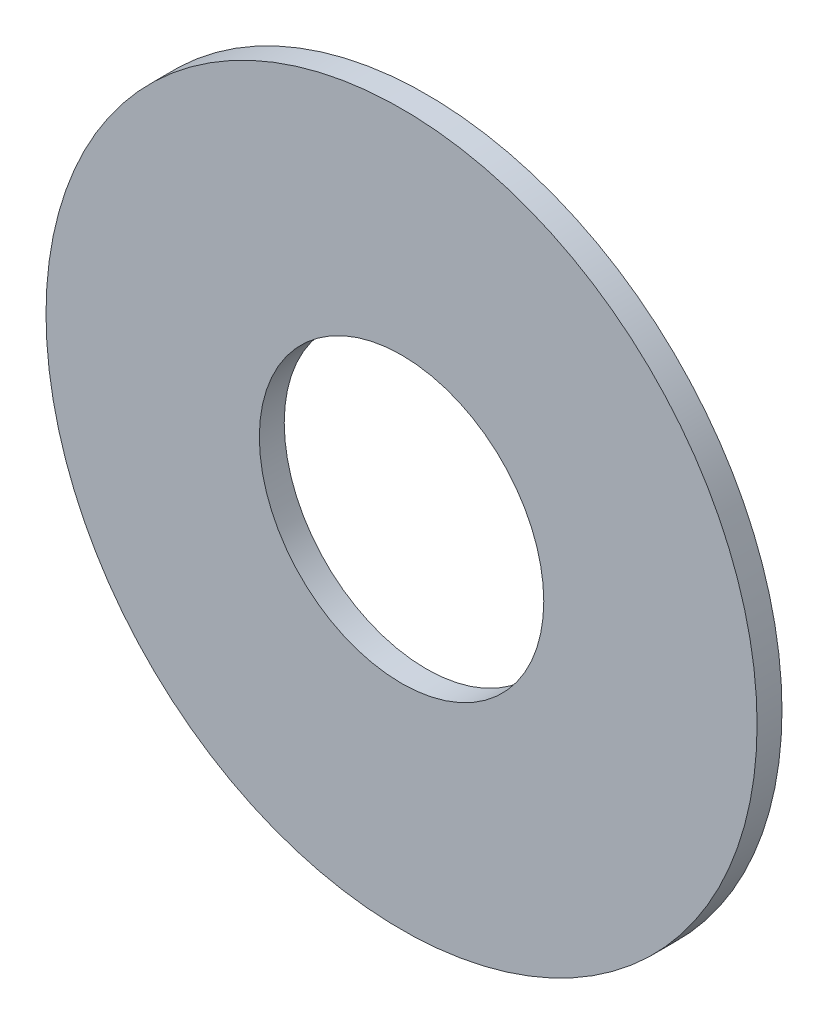
ISO-10303-21;
HEADER;
FILE_DESCRIPTION(('STEP AP214'),'2;1');
FILE_NAME('part.step','',(''),(''),'','','');
FILE_SCHEMA(('AUTOMOTIVE_DESIGN { 1 0 10303 214 1 1 1 1 }'));
ENDSEC;
DATA;
#1=APPLICATION_CONTEXT('core data for automotive mechanical design processes');
#2=APPLICATION_PROTOCOL_DEFINITION('international standard','automotive_design',2000,#1);
#3=PRODUCT_CONTEXT('',#1,'mechanical');
#4=PRODUCT('Part','Part','',(#3));
#5=PRODUCT_RELATED_PRODUCT_CATEGORY('part','',(#4));
#6=PRODUCT_DEFINITION_FORMATION('','',#4);
#7=PRODUCT_DEFINITION_CONTEXT('part definition',#1,'design');
#8=PRODUCT_DEFINITION('design','',#6,#7);
#9=PRODUCT_DEFINITION_SHAPE('','',#8);
#10=(LENGTH_UNIT() NAMED_UNIT(*) SI_UNIT(.MILLI.,.METRE.));
#11=(NAMED_UNIT(*) PLANE_ANGLE_UNIT() SI_UNIT($,.RADIAN.));
#12=(NAMED_UNIT(*) SI_UNIT($,.STERADIAN.) SOLID_ANGLE_UNIT());
#13=UNCERTAINTY_MEASURE_WITH_UNIT(LENGTH_MEASURE(1.E-05),#10,'distance_accuracy_value','');
#14=(GEOMETRIC_REPRESENTATION_CONTEXT(3) GLOBAL_UNCERTAINTY_ASSIGNED_CONTEXT((#13)) GLOBAL_UNIT_ASSIGNED_CONTEXT((#10,
#11,#12)) REPRESENTATION_CONTEXT('',''));
#15=CARTESIAN_POINT('',(0.,0.,0.));
#16=DIRECTION('',(0.,0.,1.));
#17=DIRECTION('',(1.,0.,0.));
#18=AXIS2_PLACEMENT_3D('',#15,#16,#17);
#19=CARTESIAN_POINT('',(0.,0.,0.7));
#20=DIRECTION('',(0.,0.,-1.));
#21=DIRECTION('',(-1.,0.,0.));
#22=AXIS2_PLACEMENT_3D('',#19,#20,#21);
#23=CYLINDRICAL_SURFACE('',#22,10.);
#24=CARTESIAN_POINT('',(0.,0.,0.7));
#25=DIRECTION('',(0.,0.,1.));
#26=DIRECTION('',(1.,0.,0.));
#27=AXIS2_PLACEMENT_3D('',#24,#25,#26);
#28=CIRCLE('',#27,10.);
#29=CARTESIAN_POINT('',(10.,0.,0.7));
#30=VERTEX_POINT('',#29);
#31=EDGE_CURVE('E10',#30,#30,#28,.T.);
#32=ORIENTED_EDGE('',*,*,#31,.F.);
#33=EDGE_LOOP('',(#32));
#34=FACE_BOUND('',#33,.T.);
#35=CARTESIAN_POINT('',(0.,0.,0.));
#36=DIRECTION('',(0.,0.,1.));
#37=DIRECTION('',(1.,0.,0.));
#38=AXIS2_PLACEMENT_3D('',#35,#36,#37);
#39=CIRCLE('',#38,10.);
#40=CARTESIAN_POINT('',(10.,0.,0.));
#41=VERTEX_POINT('',#40);
#42=EDGE_CURVE('E41',#41,#41,#39,.T.);
#43=ORIENTED_EDGE('',*,*,#42,.T.);
#44=EDGE_LOOP('',(#43));
#45=FACE_BOUND('',#44,.T.);
#46=ADVANCED_FACE('F34',(#34,#45),#23,.T.);
#47=CARTESIAN_POINT('',(0.,0.,0.7));
#48=DIRECTION('',(0.,0.,1.));
#49=DIRECTION('',(1.,0.,0.));
#50=AXIS2_PLACEMENT_3D('',#47,#48,#49);
#51=PLANE('',#50);
#52=CARTESIAN_POINT('',(0.,0.,0.7));
#53=DIRECTION('',(0.,0.,1.));
#54=DIRECTION('',(1.,0.,0.));
#55=AXIS2_PLACEMENT_3D('',#52,#53,#54);
#56=CIRCLE('',#55,4.);
#57=CARTESIAN_POINT('',(4.,0.,0.7));
#58=VERTEX_POINT('',#57);
#59=EDGE_CURVE('E47',#58,#58,#56,.T.);
#60=ORIENTED_EDGE('',*,*,#59,.F.);
#61=EDGE_LOOP('',(#60));
#62=FACE_BOUND('',#61,.T.);
#63=ORIENTED_EDGE('',*,*,#31,.T.);
#64=EDGE_LOOP('',(#63));
#65=FACE_BOUND('',#64,.T.);
#66=ADVANCED_FACE('F63',(#62,#65),#51,.T.);
#67=CARTESIAN_POINT('',(0.,0.,0.));
#68=DIRECTION('',(0.,0.,1.));
#69=DIRECTION('',(1.,0.,0.));
#70=AXIS2_PLACEMENT_3D('',#67,#68,#69);
#71=PLANE('',#70);
#72=CARTESIAN_POINT('',(0.,0.,0.));
#73=DIRECTION('',(0.,0.,1.));
#74=DIRECTION('',(1.,0.,0.));
#75=AXIS2_PLACEMENT_3D('',#72,#73,#74);
#76=CIRCLE('',#75,4.);
#77=CARTESIAN_POINT('',(4.,0.,0.));
#78=VERTEX_POINT('',#77);
#79=EDGE_CURVE('E37',#78,#78,#76,.T.);
#80=ORIENTED_EDGE('',*,*,#79,.T.);
#81=EDGE_LOOP('',(#80));
#82=FACE_BOUND('',#81,.T.);
#83=ORIENTED_EDGE('',*,*,#42,.F.);
#84=EDGE_LOOP('',(#83));
#85=FACE_BOUND('',#84,.T.);
#86=ADVANCED_FACE('F54',(#82,#85),#71,.F.);
#87=CARTESIAN_POINT('',(0.,0.,-0.8));
#88=DIRECTION('',(0.,0.,1.));
#89=DIRECTION('',(1.,0.,0.));
#90=AXIS2_PLACEMENT_3D('',#87,#88,#89);
#91=CYLINDRICAL_SURFACE('',#90,4.);
#92=ORIENTED_EDGE('',*,*,#59,.T.);
#93=EDGE_LOOP('',(#92));
#94=FACE_BOUND('',#93,.T.);
#95=ORIENTED_EDGE('',*,*,#79,.F.);
#96=EDGE_LOOP('',(#95));
#97=FACE_BOUND('',#96,.T.);
#98=ADVANCED_FACE('F57',(#94,#97),#91,.F.);
#99=CLOSED_SHELL('',(#46,#66,#86,#98));
#100=MANIFOLD_SOLID_BREP('B2',#99);
#101=ADVANCED_BREP_SHAPE_REPRESENTATION('',(#18,#100),#14);
#102=SHAPE_DEFINITION_REPRESENTATION(#9,#101);
ENDSEC;
END-ISO-10303-21;
